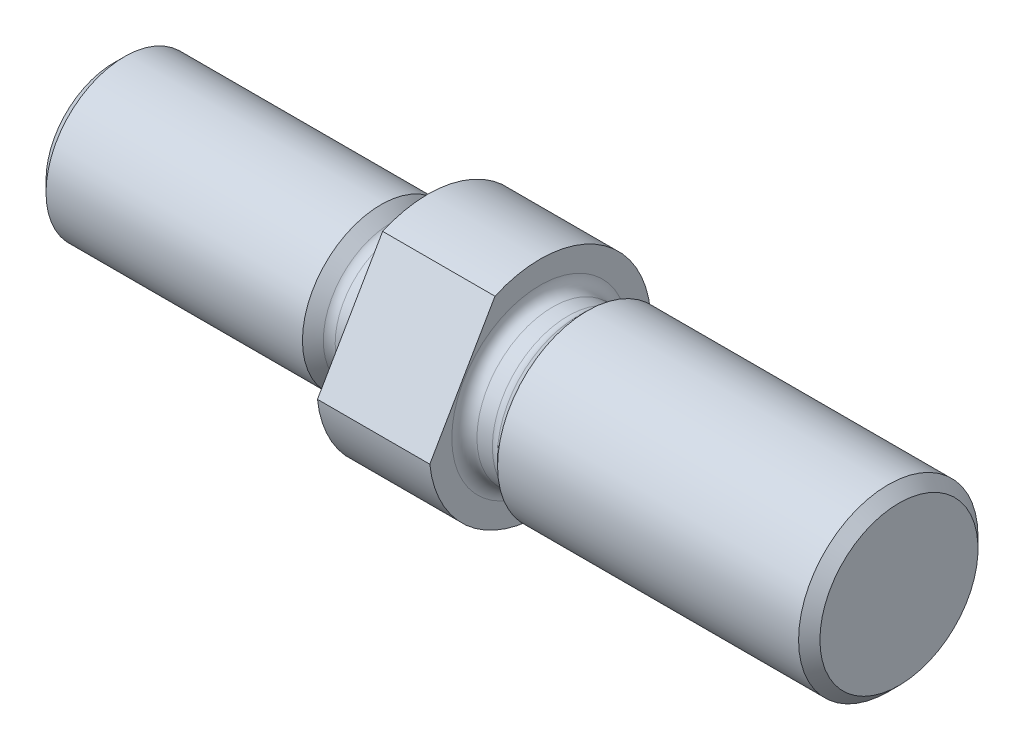
ISO-10303-21;
HEADER;
FILE_DESCRIPTION(('STEP AP214'),'2;1');
FILE_NAME('part.step','',(''),(''),'','','');
FILE_SCHEMA(('AUTOMOTIVE_DESIGN { 1 0 10303 214 1 1 1 1 }'));
ENDSEC;
DATA;
#1=APPLICATION_CONTEXT('core data for automotive mechanical design processes');
#2=APPLICATION_PROTOCOL_DEFINITION('international standard','automotive_design',2000,#1);
#3=PRODUCT_CONTEXT('',#1,'mechanical');
#4=PRODUCT('Part','Part','',(#3));
#5=PRODUCT_RELATED_PRODUCT_CATEGORY('part','',(#4));
#6=PRODUCT_DEFINITION_FORMATION('','',#4);
#7=PRODUCT_DEFINITION_CONTEXT('part definition',#1,'design');
#8=PRODUCT_DEFINITION('design','',#6,#7);
#9=PRODUCT_DEFINITION_SHAPE('','',#8);
#10=(LENGTH_UNIT() NAMED_UNIT(*) SI_UNIT(.MILLI.,.METRE.));
#11=(NAMED_UNIT(*) PLANE_ANGLE_UNIT() SI_UNIT($,.RADIAN.));
#12=(NAMED_UNIT(*) SI_UNIT($,.STERADIAN.) SOLID_ANGLE_UNIT());
#13=UNCERTAINTY_MEASURE_WITH_UNIT(LENGTH_MEASURE(1.E-05),#10,'distance_accuracy_value','');
#14=(GEOMETRIC_REPRESENTATION_CONTEXT(3) GLOBAL_UNCERTAINTY_ASSIGNED_CONTEXT((#13)) GLOBAL_UNIT_ASSIGNED_CONTEXT((#10,
#11,#12)) REPRESENTATION_CONTEXT('',''));
#15=CARTESIAN_POINT('',(0.,0.,0.));
#16=DIRECTION('',(0.,0.,1.));
#17=DIRECTION('',(1.,0.,0.));
#18=AXIS2_PLACEMENT_3D('',#15,#16,#17);
#19=CARTESIAN_POINT('',(30.1752,0.,0.));
#20=DIRECTION('',(-1.,0.,0.));
#21=DIRECTION('',(0.,0.,1.));
#22=AXIS2_PLACEMENT_3D('',#19,#20,#21);
#23=CYLINDRICAL_SURFACE('',#22,7.84860000000015);
#24=CARTESIAN_POINT('',(30.1752,0.,0.));
#25=DIRECTION('',(-1.,0.,0.));
#26=DIRECTION('',(0.,0.,1.));
#27=AXIS2_PLACEMENT_3D('',#24,#25,#26);
#28=CIRCLE('',#27,7.8486);
#29=CARTESIAN_POINT('',(30.1752,7.16981119328582,3.19285599622591));
#30=VERTEX_POINT('',#29);
#31=CARTESIAN_POINT('',(30.1752,0.819811193285826,-7.80566663183649));
#32=VERTEX_POINT('',#31);
#33=EDGE_CURVE('E82',#30,#32,#28,.T.);
#34=ORIENTED_EDGE('',*,*,#33,.T.);
#35=DIRECTION('',(-1.,0.,0.));
#36=VECTOR('',#35,1.);
#37=CARTESIAN_POINT('',(30.1752,0.819811193285826,-7.80566663183649));
#38=LINE('',#37,#36);
#39=CARTESIAN_POINT('',(22.2250000000003,0.819811193286042,-7.80566663183662));
#40=VERTEX_POINT('',#39);
#41=EDGE_CURVE('E105',#32,#40,#38,.T.);
#42=ORIENTED_EDGE('',*,*,#41,.T.);
#43=CARTESIAN_POINT('',(22.2250000000003,0.,0.));
#44=DIRECTION('',(-1.,0.,0.));
#45=DIRECTION('',(0.,0.,1.));
#46=AXIS2_PLACEMENT_3D('',#43,#44,#45);
#47=CIRCLE('',#46,7.8486000000003);
#48=CARTESIAN_POINT('',(22.2250000000003,7.16981119328604,3.19285599622579));
#49=VERTEX_POINT('',#48);
#50=EDGE_CURVE('E93',#49,#40,#47,.T.);
#51=ORIENTED_EDGE('',*,*,#50,.F.);
#52=DIRECTION('',(-1.,0.,0.));
#53=VECTOR('',#52,1.);
#54=CARTESIAN_POINT('',(30.1752,7.16981119328582,3.19285599622591));
#55=LINE('',#54,#53);
#56=EDGE_CURVE('E59',#49,#30,#55,.F.);
#57=ORIENTED_EDGE('',*,*,#56,.T.);
#58=EDGE_LOOP('',(#34,#42,#51,#57));
#59=FACE_BOUND('',#58,.T.);
#60=ADVANCED_FACE('F37',(#59),#23,.T.);
#61=CARTESIAN_POINT('',(30.1752,7.8486,0.));
#62=DIRECTION('',(-1.,0.,0.));
#63=DIRECTION('',(0.,0.,1.));
#64=AXIS2_PLACEMENT_3D('',#61,#62,#63);
#65=PLANE('',#64);
#66=CARTESIAN_POINT('',(30.1752,0.,0.));
#67=DIRECTION('',(-1.,0.,0.));
#68=DIRECTION('',(0.,0.,1.));
#69=AXIS2_PLACEMENT_3D('',#66,#67,#68);
#70=CIRCLE('',#69,6.2484);
#71=CARTESIAN_POINT('',(30.1752,0.,6.2484));
#72=VERTEX_POINT('',#71);
#73=EDGE_CURVE('E109',#72,#72,#70,.T.);
#74=ORIENTED_EDGE('',*,*,#73,.T.);
#75=EDGE_LOOP('',(#74));
#76=FACE_BOUND('',#75,.T.);
#77=CARTESIAN_POINT('',(30.1752,-7.16981119328582,-3.19285599622591));
#78=VERTEX_POINT('',#77);
#79=CARTESIAN_POINT('',(30.1752,-0.819811193285826,7.80566663183649));
#80=VERTEX_POINT('',#79);
#81=EDGE_CURVE('E89',#78,#80,#28,.T.);
#82=ORIENTED_EDGE('',*,*,#81,.F.);
#83=DIRECTION('',(0.,0.86602540378444,-0.499999999999998));
#84=VECTOR('',#83,1.);
#85=CARTESIAN_POINT('',(30.1752,2.71145000000002,-8.89780480610247));
#86=LINE('',#85,#84);
#87=EDGE_CURVE('E108',#78,#32,#86,.T.);
#88=ORIENTED_EDGE('',*,*,#87,.T.);
#89=ORIENTED_EDGE('',*,*,#33,.F.);
#90=DIRECTION('',(0.,-0.86602540378444,0.499999999999998));
#91=VECTOR('',#90,1.);
#92=CARTESIAN_POINT('',(30.1752,9.06145000000001,2.10071782195994));
#93=LINE('',#92,#91);
#94=EDGE_CURVE('E90',#30,#80,#93,.T.);
#95=ORIENTED_EDGE('',*,*,#94,.T.);
#96=EDGE_LOOP('',(#82,#88,#89,#95));
#97=FACE_BOUND('',#96,.T.);
#98=ADVANCED_FACE('F39',(#76,#97),#65,.F.);
#99=CARTESIAN_POINT('',(22.2250000000003,-7.16981119328604,-3.19285599622579));
#100=VERTEX_POINT('',#99);
#101=CARTESIAN_POINT('',(22.2250000000003,-0.819811193286044,7.80566663183662));
#102=VERTEX_POINT('',#101);
#103=EDGE_CURVE('E87',#100,#102,#47,.T.);
#104=ORIENTED_EDGE('',*,*,#103,.F.);
#105=DIRECTION('',(-1.,0.,0.));
#106=VECTOR('',#105,1.);
#107=CARTESIAN_POINT('',(30.1752,-7.16981119328582,-3.19285599622591));
#108=LINE('',#107,#106);
#109=EDGE_CURVE('E52',#100,#78,#108,.F.);
#110=ORIENTED_EDGE('',*,*,#109,.T.);
#111=ORIENTED_EDGE('',*,*,#81,.T.);
#112=DIRECTION('',(-1.,0.,0.));
#113=VECTOR('',#112,1.);
#114=CARTESIAN_POINT('',(30.1752,-0.819811193285826,7.80566663183649));
#115=LINE('',#114,#113);
#116=EDGE_CURVE('E76',#80,#102,#115,.T.);
#117=ORIENTED_EDGE('',*,*,#116,.T.);
#118=EDGE_LOOP('',(#104,#110,#111,#117));
#119=FACE_BOUND('',#118,.T.);
#120=ADVANCED_FACE('F86',(#119),#23,.T.);
#121=CARTESIAN_POINT('',(22.2250000000003,5.4101999999995,0.));
#122=DIRECTION('',(1.,0.,0.));
#123=DIRECTION('',(0.,0.,-1.));
#124=AXIS2_PLACEMENT_3D('',#121,#122,#123);
#125=PLANE('',#124);
#126=CARTESIAN_POINT('',(22.2250000000003,0.,0.));
#127=DIRECTION('',(-1.,0.,0.));
#128=DIRECTION('',(0.,0.,1.));
#129=AXIS2_PLACEMENT_3D('',#126,#127,#128);
#130=CIRCLE('',#129,5.4101999999995);
#131=CARTESIAN_POINT('',(22.2250000000003,0.,5.4101999999995));
#132=VERTEX_POINT('',#131);
#133=EDGE_CURVE('E94',#132,#132,#130,.T.);
#134=ORIENTED_EDGE('',*,*,#133,.F.);
#135=EDGE_LOOP('',(#134));
#136=FACE_BOUND('',#135,.T.);
#137=ORIENTED_EDGE('',*,*,#50,.T.);
#138=DIRECTION('',(0.,-0.86602540378444,0.499999999999998));
#139=VECTOR('',#138,1.);
#140=CARTESIAN_POINT('',(22.2250000000003,0.882649999999641,-7.84194663380827));
#141=LINE('',#140,#139);
#142=EDGE_CURVE('E11',#40,#100,#141,.T.);
#143=ORIENTED_EDGE('',*,*,#142,.T.);
#144=ORIENTED_EDGE('',*,*,#103,.T.);
#145=DIRECTION('',(0.,0.86602540378444,-0.499999999999998));
#146=VECTOR('',#145,1.);
#147=CARTESIAN_POINT('',(22.2250000000003,7.23264999999963,3.15657599425414));
#148=LINE('',#147,#146);
#149=EDGE_CURVE('E45',#102,#49,#148,.T.);
#150=ORIENTED_EDGE('',*,*,#149,.T.);
#151=EDGE_LOOP('',(#137,#143,#144,#150));
#152=FACE_BOUND('',#151,.T.);
#153=ADVANCED_FACE('F92',(#136,#152),#125,.F.);
#154=CARTESIAN_POINT('',(21.3868000000011,0.,0.));
#155=DIRECTION('',(-1.,0.,0.));
#156=DIRECTION('',(0.,0.,1.));
#157=AXIS2_PLACEMENT_3D('',#154,#155,#156);
#158=TOROIDAL_SURFACE('',#157,5.4101999999995,0.838199999999204);
#159=CARTESIAN_POINT('',(21.3868000000011,0.,0.));
#160=DIRECTION('',(-1.,0.,0.));
#161=DIRECTION('',(0.,0.,1.));
#162=AXIS2_PLACEMENT_3D('',#159,#160,#161);
#163=CIRCLE('',#162,4.5720000000003);
#164=CARTESIAN_POINT('',(21.3868000000011,0.,4.5720000000003));
#165=VERTEX_POINT('',#164);
#166=EDGE_CURVE('E97',#165,#165,#163,.T.);
#167=ORIENTED_EDGE('',*,*,#166,.F.);
#168=EDGE_LOOP('',(#167));
#169=FACE_BOUND('',#168,.T.);
#170=ORIENTED_EDGE('',*,*,#133,.T.);
#171=EDGE_LOOP('',(#170));
#172=FACE_BOUND('',#171,.T.);
#173=ADVANCED_FACE('F153',(#169,#172),#158,.F.);
#174=CARTESIAN_POINT('',(30.1752,0.,0.));
#175=DIRECTION('',(-1.,0.,0.));
#176=DIRECTION('',(0.,0.,1.));
#177=AXIS2_PLACEMENT_3D('',#174,#175,#176);
#178=CYLINDRICAL_SURFACE('',#177,4.5720000000003);
#179=CARTESIAN_POINT('',(20.2438000000014,0.,0.));
#180=DIRECTION('',(-1.,0.,0.));
#181=DIRECTION('',(0.,0.,1.));
#182=AXIS2_PLACEMENT_3D('',#179,#180,#181);
#183=CIRCLE('',#182,4.5720000000003);
#184=CARTESIAN_POINT('',(20.2438000000014,0.,4.5720000000003));
#185=VERTEX_POINT('',#184);
#186=EDGE_CURVE('E146',#185,#185,#183,.T.);
#187=ORIENTED_EDGE('',*,*,#186,.F.);
#188=EDGE_LOOP('',(#187));
#189=FACE_BOUND('',#188,.T.);
#190=ORIENTED_EDGE('',*,*,#166,.T.);
#191=EDGE_LOOP('',(#190));
#192=FACE_BOUND('',#191,.T.);
#193=ADVANCED_FACE('F151',(#189,#192),#178,.T.);
#194=CARTESIAN_POINT('',(20.2438000000014,0.,0.));
#195=DIRECTION('',(-1.,0.,0.));
#196=DIRECTION('',(0.,0.,1.));
#197=AXIS2_PLACEMENT_3D('',#194,#195,#196);
#198=TOROIDAL_SURFACE('',#197,5.41020000000399,0.838200000003694);
#199=CARTESIAN_POINT('',(19.6511030960082,0.,0.));
#200=DIRECTION('',(-1.,0.,0.));
#201=DIRECTION('',(0.,0.,1.));
#202=AXIS2_PLACEMENT_3D('',#199,#200,#201);
#203=CIRCLE('',#202,4.81750309601082);
#204=CARTESIAN_POINT('',(19.6511030960082,0.,4.81750309601082));
#205=VERTEX_POINT('',#204);
#206=EDGE_CURVE('E143',#205,#205,#203,.T.);
#207=ORIENTED_EDGE('',*,*,#206,.F.);
#208=EDGE_LOOP('',(#207));
#209=FACE_BOUND('',#208,.T.);
#210=ORIENTED_EDGE('',*,*,#186,.T.);
#211=EDGE_LOOP('',(#210));
#212=FACE_BOUND('',#211,.T.);
#213=ADVANCED_FACE('F230',(#209,#212),#198,.F.);
#214=CARTESIAN_POINT('',(19.6511030960082,0.,0.));
#215=DIRECTION('',(-1.,0.,0.));
#216=DIRECTION('',(0.,0.,1.));
#217=AXIS2_PLACEMENT_3D('',#214,#215,#216);
#218=CONICAL_SURFACE('',#217,4.81750309601082,0.785398163397447);
#219=CARTESIAN_POINT('',(18.912356192019,0.,0.));
#220=DIRECTION('',(-1.,0.,0.));
#221=DIRECTION('',(0.,0.,1.));
#222=AXIS2_PLACEMENT_3D('',#219,#220,#221);
#223=CIRCLE('',#222,5.55625);
#224=CARTESIAN_POINT('',(18.912356192019,0.,5.55625));
#225=VERTEX_POINT('',#224);
#226=EDGE_CURVE('E140',#225,#225,#223,.T.);
#227=ORIENTED_EDGE('',*,*,#226,.F.);
#228=EDGE_LOOP('',(#227));
#229=FACE_BOUND('',#228,.T.);
#230=ORIENTED_EDGE('',*,*,#206,.T.);
#231=EDGE_LOOP('',(#230));
#232=FACE_BOUND('',#231,.T.);
#233=ADVANCED_FACE('F226',(#229,#232),#218,.T.);
#234=CARTESIAN_POINT('',(30.1752,0.,0.));
#235=DIRECTION('',(-1.,0.,0.));
#236=DIRECTION('',(0.,0.,1.));
#237=AXIS2_PLACEMENT_3D('',#234,#235,#236);
#238=CYLINDRICAL_SURFACE('',#237,5.55625);
#239=CARTESIAN_POINT('',(0.761999999999999,0.,0.));
#240=DIRECTION('',(-1.,0.,0.));
#241=DIRECTION('',(0.,0.,1.));
#242=AXIS2_PLACEMENT_3D('',#239,#240,#241);
#243=CIRCLE('',#242,5.55625);
#244=CARTESIAN_POINT('',(0.761999999999999,0.,5.55625));
#245=VERTEX_POINT('',#244);
#246=EDGE_CURVE('E137',#245,#245,#243,.T.);
#247=ORIENTED_EDGE('',*,*,#246,.F.);
#248=EDGE_LOOP('',(#247));
#249=FACE_BOUND('',#248,.T.);
#250=ORIENTED_EDGE('',*,*,#226,.T.);
#251=EDGE_LOOP('',(#250));
#252=FACE_BOUND('',#251,.T.);
#253=ADVANCED_FACE('F222',(#249,#252),#238,.T.);
#254=CARTESIAN_POINT('',(0.761999999999999,0.,0.));
#255=DIRECTION('',(1.,0.,0.));
#256=DIRECTION('',(0.,0.,-1.));
#257=AXIS2_PLACEMENT_3D('',#254,#255,#256);
#258=CONICAL_SURFACE('',#257,5.55625,0.78539816339745);
#259=CARTESIAN_POINT('',(0.,0.,0.));
#260=DIRECTION('',(-1.,0.,0.));
#261=DIRECTION('',(0.,0.,1.));
#262=AXIS2_PLACEMENT_3D('',#259,#260,#261);
#263=CIRCLE('',#262,4.79425);
#264=CARTESIAN_POINT('',(0.,0.,4.79425));
#265=VERTEX_POINT('',#264);
#266=EDGE_CURVE('E134',#265,#265,#263,.T.);
#267=ORIENTED_EDGE('',*,*,#266,.F.);
#268=EDGE_LOOP('',(#267));
#269=FACE_BOUND('',#268,.T.);
#270=ORIENTED_EDGE('',*,*,#246,.T.);
#271=EDGE_LOOP('',(#270));
#272=FACE_BOUND('',#271,.T.);
#273=ADVANCED_FACE('F216',(#269,#272),#258,.T.);
#274=CARTESIAN_POINT('',(0.,0.,0.));
#275=DIRECTION('',(1.,0.,0.));
#276=DIRECTION('',(0.,0.,-1.));
#277=AXIS2_PLACEMENT_3D('',#274,#275,#276);
#278=PLANE('',#277);
#279=ORIENTED_EDGE('',*,*,#266,.T.);
#280=EDGE_LOOP('',(#279));
#281=FACE_BOUND('',#280,.T.);
#282=ADVANCED_FACE('F211',(#281),#278,.F.);
#283=CARTESIAN_POINT('',(55.5752,5.59435,0.));
#284=DIRECTION('',(-1.,0.,0.));
#285=DIRECTION('',(0.,0.,1.));
#286=AXIS2_PLACEMENT_3D('',#283,#284,#285);
#287=PLANE('',#286);
#288=CARTESIAN_POINT('',(55.5752,0.,0.));
#289=DIRECTION('',(-1.,0.,0.));
#290=DIRECTION('',(0.,0.,1.));
#291=AXIS2_PLACEMENT_3D('',#288,#289,#290);
#292=CIRCLE('',#291,5.59435);
#293=CARTESIAN_POINT('',(55.5752,0.,5.59435));
#294=VERTEX_POINT('',#293);
#295=EDGE_CURVE('E131',#294,#294,#292,.T.);
#296=ORIENTED_EDGE('',*,*,#295,.F.);
#297=EDGE_LOOP('',(#296));
#298=FACE_BOUND('',#297,.T.);
#299=ADVANCED_FACE('F206',(#298),#287,.F.);
#300=CARTESIAN_POINT('',(55.5752,0.,0.));
#301=DIRECTION('',(-1.,0.,0.));
#302=DIRECTION('',(0.,0.,1.));
#303=AXIS2_PLACEMENT_3D('',#300,#301,#302);
#304=CONICAL_SURFACE('',#303,5.59435,0.785398163397445);
#305=CARTESIAN_POINT('',(54.81955,0.,0.));
#306=DIRECTION('',(-1.,0.,0.));
#307=DIRECTION('',(0.,0.,1.));
#308=AXIS2_PLACEMENT_3D('',#305,#306,#307);
#309=CIRCLE('',#308,6.35);
#310=CARTESIAN_POINT('',(54.81955,0.,6.35));
#311=VERTEX_POINT('',#310);
#312=EDGE_CURVE('E128',#311,#311,#309,.T.);
#313=ORIENTED_EDGE('',*,*,#312,.F.);
#314=EDGE_LOOP('',(#313));
#315=FACE_BOUND('',#314,.T.);
#316=ORIENTED_EDGE('',*,*,#295,.T.);
#317=EDGE_LOOP('',(#316));
#318=FACE_BOUND('',#317,.T.);
#319=ADVANCED_FACE('F200',(#315,#318),#304,.T.);
#320=CARTESIAN_POINT('',(55.5752,0.,0.));
#321=DIRECTION('',(-1.,0.,0.));
#322=DIRECTION('',(0.,0.,1.));
#323=AXIS2_PLACEMENT_3D('',#320,#321,#322);
#324=CYLINDRICAL_SURFACE('',#323,6.35);
#325=CARTESIAN_POINT('',(33.51523585695,0.,0.));
#326=DIRECTION('',(-1.,0.,0.));
#327=DIRECTION('',(0.,0.,1.));
#328=AXIS2_PLACEMENT_3D('',#325,#326,#327);
#329=CIRCLE('',#328,6.35);
#330=CARTESIAN_POINT('',(33.51523585695,0.,6.35));
#331=VERTEX_POINT('',#330);
#332=EDGE_CURVE('E125',#331,#331,#329,.T.);
#333=ORIENTED_EDGE('',*,*,#332,.F.);
#334=EDGE_LOOP('',(#333));
#335=FACE_BOUND('',#334,.T.);
#336=ORIENTED_EDGE('',*,*,#312,.T.);
#337=EDGE_LOOP('',(#336));
#338=FACE_BOUND('',#337,.T.);
#339=ADVANCED_FACE('F194',(#335,#338),#324,.T.);
#340=CARTESIAN_POINT('',(33.51523585695,0.,0.));
#341=DIRECTION('',(1.,0.,0.));
#342=DIRECTION('',(0.,0.,-1.));
#343=AXIS2_PLACEMENT_3D('',#340,#341,#342);
#344=CONICAL_SURFACE('',#343,6.35,0.785398163397308);
#345=CARTESIAN_POINT('',(32.785017928475,0.,0.));
#346=DIRECTION('',(-1.,0.,0.));
#347=DIRECTION('',(0.,0.,1.));
#348=AXIS2_PLACEMENT_3D('',#345,#346,#347);
#349=CIRCLE('',#348,5.6197820715252);
#350=CARTESIAN_POINT('',(32.785017928475,0.,5.6197820715252));
#351=VERTEX_POINT('',#350);
#352=EDGE_CURVE('E122',#351,#351,#349,.T.);
#353=ORIENTED_EDGE('',*,*,#352,.F.);
#354=EDGE_LOOP('',(#353));
#355=FACE_BOUND('',#354,.T.);
#356=ORIENTED_EDGE('',*,*,#332,.T.);
#357=EDGE_LOOP('',(#356));
#358=FACE_BOUND('',#357,.T.);
#359=ADVANCED_FACE('F188',(#355,#358),#344,.T.);
#360=CARTESIAN_POINT('',(32.1564000000006,0.,0.));
#361=DIRECTION('',(-1.,0.,0.));
#362=DIRECTION('',(0.,0.,1.));
#363=AXIS2_PLACEMENT_3D('',#360,#361,#362);
#364=TOROIDAL_SURFACE('',#363,6.24839999999888,0.88899999999888);
#365=CARTESIAN_POINT('',(32.1564,0.,0.));
#366=DIRECTION('',(-1.,0.,0.));
#367=DIRECTION('',(0.,0.,1.));
#368=AXIS2_PLACEMENT_3D('',#365,#366,#367);
#369=CIRCLE('',#368,5.3594);
#370=CARTESIAN_POINT('',(32.1564,0.,5.3594));
#371=VERTEX_POINT('',#370);
#372=EDGE_CURVE('E119',#371,#371,#369,.T.);
#373=ORIENTED_EDGE('',*,*,#372,.F.);
#374=EDGE_LOOP('',(#373));
#375=FACE_BOUND('',#374,.T.);
#376=ORIENTED_EDGE('',*,*,#352,.T.);
#377=EDGE_LOOP('',(#376));
#378=FACE_BOUND('',#377,.T.);
#379=ADVANCED_FACE('F182',(#375,#378),#364,.F.);
#380=CARTESIAN_POINT('',(55.5752,0.,0.));
#381=DIRECTION('',(-1.,0.,0.));
#382=DIRECTION('',(0.,0.,1.));
#383=AXIS2_PLACEMENT_3D('',#380,#381,#382);
#384=CYLINDRICAL_SURFACE('',#383,5.3594);
#385=CARTESIAN_POINT('',(31.0642,0.,0.));
#386=DIRECTION('',(-1.,0.,0.));
#387=DIRECTION('',(0.,0.,1.));
#388=AXIS2_PLACEMENT_3D('',#385,#386,#387);
#389=CIRCLE('',#388,5.3594);
#390=CARTESIAN_POINT('',(31.0642,0.,5.3594));
#391=VERTEX_POINT('',#390);
#392=EDGE_CURVE('E112',#391,#391,#389,.T.);
#393=ORIENTED_EDGE('',*,*,#392,.F.);
#394=EDGE_LOOP('',(#393));
#395=FACE_BOUND('',#394,.T.);
#396=ORIENTED_EDGE('',*,*,#372,.T.);
#397=EDGE_LOOP('',(#396));
#398=FACE_BOUND('',#397,.T.);
#399=ADVANCED_FACE('F176',(#395,#398),#384,.T.);
#400=CARTESIAN_POINT('',(31.0641999999998,0.,0.));
#401=DIRECTION('',(-1.,0.,0.));
#402=DIRECTION('',(0.,0.,1.));
#403=AXIS2_PLACEMENT_3D('',#400,#401,#402);
#404=TOROIDAL_SURFACE('',#403,6.2483999999998,0.888999999999803);
#405=ORIENTED_EDGE('',*,*,#73,.F.);
#406=EDGE_LOOP('',(#405));
#407=FACE_BOUND('',#406,.T.);
#408=ORIENTED_EDGE('',*,*,#392,.T.);
#409=EDGE_LOOP('',(#408));
#410=FACE_BOUND('',#409,.T.);
#411=ADVANCED_FACE('F173',(#407,#410),#404,.F.);
#412=CARTESIAN_POINT('',(31.4452,8.8424310291348,2.2271684837466));
#413=DIRECTION('',(0.,-0.499999999999998,-0.86602540378444));
#414=DIRECTION('',(0.,0.86602540378444,-0.499999999999998));
#415=AXIS2_PLACEMENT_3D('',#412,#413,#414);
#416=PLANE('',#415);
#417=ORIENTED_EDGE('',*,*,#56,.F.);
#418=ORIENTED_EDGE('',*,*,#149,.F.);
#419=ORIENTED_EDGE('',*,*,#116,.F.);
#420=ORIENTED_EDGE('',*,*,#94,.F.);
#421=EDGE_LOOP('',(#417,#418,#419,#420));
#422=FACE_BOUND('',#421,.T.);
#423=ADVANCED_FACE('F75',(#422),#416,.F.);
#424=CARTESIAN_POINT('',(31.4452,-8.8424310291348,-2.2271684837466));
#425=DIRECTION('',(0.,0.499999999999998,0.86602540378444));
#426=DIRECTION('',(0.,-0.86602540378444,0.499999999999998));
#427=AXIS2_PLACEMENT_3D('',#424,#425,#426);
#428=PLANE('',#427);
#429=ORIENTED_EDGE('',*,*,#109,.F.);
#430=ORIENTED_EDGE('',*,*,#142,.F.);
#431=ORIENTED_EDGE('',*,*,#41,.F.);
#432=ORIENTED_EDGE('',*,*,#87,.F.);
#433=EDGE_LOOP('',(#429,#430,#431,#432));
#434=FACE_BOUND('',#433,.T.);
#435=ADVANCED_FACE('F334',(#434),#428,.F.);
#436=CLOSED_SHELL('',(#60,#98,#120,#153,#173,#193,#213,#233,#253,#273,#282,#299,#319,#339,#359,
#379,#399,#411,#423,#435));
#437=MANIFOLD_SOLID_BREP('B2',#436);
#438=ADVANCED_BREP_SHAPE_REPRESENTATION('',(#18,#437),#14);
#439=SHAPE_DEFINITION_REPRESENTATION(#9,#438);
ENDSEC;
END-ISO-10303-21;
